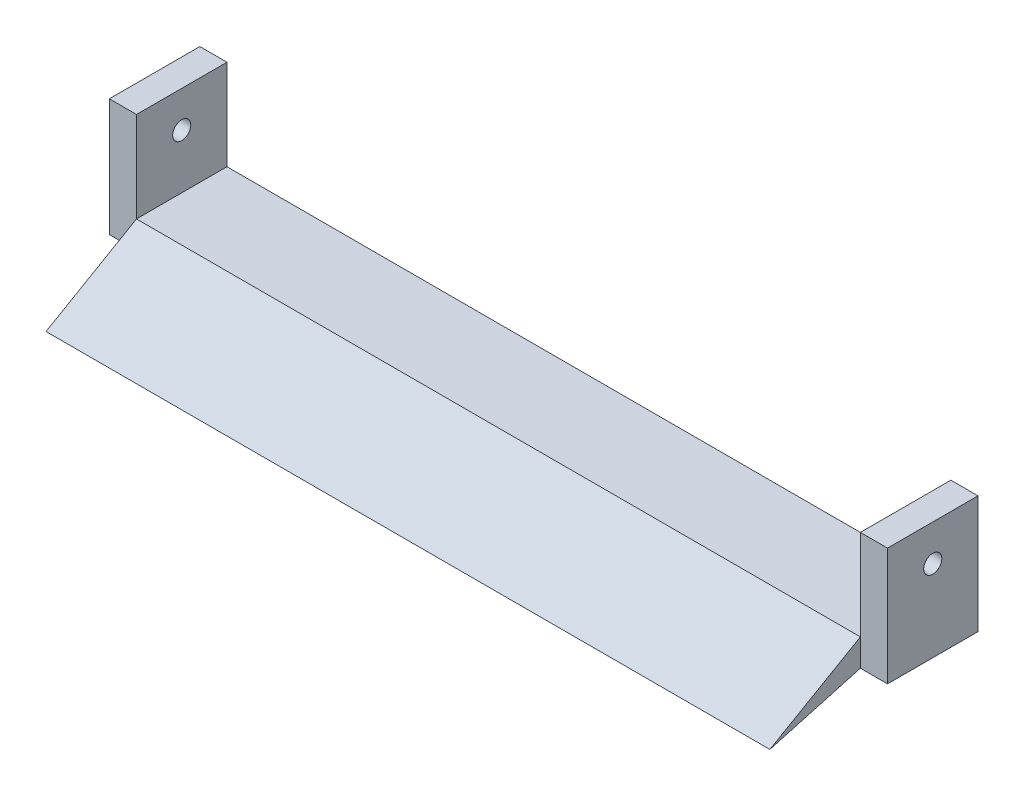
ISO-10303-21;
HEADER;
FILE_DESCRIPTION(('STEP AP214'),'2;1');
FILE_NAME('part.step','',(''),(''),'','','');
FILE_SCHEMA(('AUTOMOTIVE_DESIGN { 1 0 10303 214 1 1 1 1 }'));
ENDSEC;
DATA;
#1=APPLICATION_CONTEXT('core data for automotive mechanical design processes');
#2=APPLICATION_PROTOCOL_DEFINITION('international standard','automotive_design',2000,#1);
#3=PRODUCT_CONTEXT('',#1,'mechanical');
#4=PRODUCT('Part','Part','',(#3));
#5=PRODUCT_RELATED_PRODUCT_CATEGORY('part','',(#4));
#6=PRODUCT_DEFINITION_FORMATION('','',#4);
#7=PRODUCT_DEFINITION_CONTEXT('part definition',#1,'design');
#8=PRODUCT_DEFINITION('design','',#6,#7);
#9=PRODUCT_DEFINITION_SHAPE('','',#8);
#10=(LENGTH_UNIT() NAMED_UNIT(*) SI_UNIT(.MILLI.,.METRE.));
#11=(NAMED_UNIT(*) PLANE_ANGLE_UNIT() SI_UNIT($,.RADIAN.));
#12=(NAMED_UNIT(*) SI_UNIT($,.STERADIAN.) SOLID_ANGLE_UNIT());
#13=UNCERTAINTY_MEASURE_WITH_UNIT(LENGTH_MEASURE(1.E-05),#10,'distance_accuracy_value','');
#14=(GEOMETRIC_REPRESENTATION_CONTEXT(3) GLOBAL_UNCERTAINTY_ASSIGNED_CONTEXT((#13)) GLOBAL_UNIT_ASSIGNED_CONTEXT((#10,
#11,#12)) REPRESENTATION_CONTEXT('',''));
#15=CARTESIAN_POINT('',(0.,0.,0.));
#16=DIRECTION('',(0.,0.,1.));
#17=DIRECTION('',(1.,0.,0.));
#18=AXIS2_PLACEMENT_3D('',#15,#16,#17);
#19=CARTESIAN_POINT('',(0.,0.,50.));
#20=DIRECTION('',(0.,0.,-1.));
#21=DIRECTION('',(-1.,0.,0.));
#22=AXIS2_PLACEMENT_3D('',#19,#20,#21);
#23=PLANE('',#22);
#24=DIRECTION('',(0.,1.,0.));
#25=VECTOR('',#24,1.);
#26=CARTESIAN_POINT('',(200.,-17.5,50.));
#27=LINE('',#26,#25);
#28=CARTESIAN_POINT('',(200.,-32.5,50.));
#29=VERTEX_POINT('',#28);
#30=CARTESIAN_POINT('',(200.,-17.5,50.));
#31=VERTEX_POINT('',#30);
#32=EDGE_CURVE('E49',#29,#31,#27,.T.);
#33=ORIENTED_EDGE('',*,*,#32,.F.);
#34=DIRECTION('',(1.,0.,0.));
#35=VECTOR('',#34,1.);
#36=CARTESIAN_POINT('',(-215.,-32.5,50.));
#37=LINE('',#36,#35);
#38=CARTESIAN_POINT('',(215.,-32.5,50.));
#39=VERTEX_POINT('',#38);
#40=EDGE_CURVE('E180',#29,#39,#37,.T.);
#41=ORIENTED_EDGE('',*,*,#40,.T.);
#42=DIRECTION('',(0.,1.,0.));
#43=VECTOR('',#42,1.);
#44=CARTESIAN_POINT('',(215.,-32.5,50.));
#45=LINE('',#44,#43);
#46=CARTESIAN_POINT('',(215.,32.5,50.));
#47=VERTEX_POINT('',#46);
#48=EDGE_CURVE('E171',#39,#47,#45,.T.);
#49=ORIENTED_EDGE('',*,*,#48,.T.);
#50=DIRECTION('',(-1.,0.,0.));
#51=VECTOR('',#50,1.);
#52=CARTESIAN_POINT('',(200.,32.5,50.));
#53=LINE('',#52,#51);
#54=CARTESIAN_POINT('',(200.,32.5,50.));
#55=VERTEX_POINT('',#54);
#56=EDGE_CURVE('E135',#47,#55,#53,.T.);
#57=ORIENTED_EDGE('',*,*,#56,.T.);
#58=DIRECTION('',(0.,-1.,0.));
#59=VECTOR('',#58,1.);
#60=CARTESIAN_POINT('',(200.,32.5,50.));
#61=LINE('',#60,#59);
#62=EDGE_CURVE('E125',#55,#31,#61,.T.);
#63=ORIENTED_EDGE('',*,*,#62,.T.);
#64=EDGE_LOOP('',(#33,#41,#49,#57,#63));
#65=FACE_BOUND('',#64,.T.);
#66=ADVANCED_FACE('F33',(#65),#23,.F.);
#67=CARTESIAN_POINT('',(215.,-32.5,50.));
#68=DIRECTION('',(-1.,0.,0.));
#69=DIRECTION('',(0.,0.,1.));
#70=AXIS2_PLACEMENT_3D('',#67,#68,#69);
#71=PLANE('',#70);
#72=CARTESIAN_POINT('',(215.,12.5,25.));
#73=DIRECTION('',(1.,0.,0.));
#74=DIRECTION('',(0.,0.,-1.));
#75=AXIS2_PLACEMENT_3D('',#72,#73,#74);
#76=CIRCLE('',#75,5.);
#77=CARTESIAN_POINT('',(215.,12.5,20.));
#78=VERTEX_POINT('',#77);
#79=EDGE_CURVE('E161',#78,#78,#76,.T.);
#80=ORIENTED_EDGE('',*,*,#79,.F.);
#81=EDGE_LOOP('',(#80));
#82=FACE_BOUND('',#81,.T.);
#83=DIRECTION('',(0.,1.,0.));
#84=VECTOR('',#83,1.);
#85=CARTESIAN_POINT('',(215.,-32.5,0.));
#86=LINE('',#85,#84);
#87=CARTESIAN_POINT('',(215.,-32.5,0.));
#88=VERTEX_POINT('',#87);
#89=CARTESIAN_POINT('',(215.,32.5,0.));
#90=VERTEX_POINT('',#89);
#91=EDGE_CURVE('E170',#88,#90,#86,.T.);
#92=ORIENTED_EDGE('',*,*,#91,.T.);
#93=DIRECTION('',(0.,0.,-1.));
#94=VECTOR('',#93,1.);
#95=CARTESIAN_POINT('',(215.,32.5,50.));
#96=LINE('',#95,#94);
#97=EDGE_CURVE('E11',#47,#90,#96,.T.);
#98=ORIENTED_EDGE('',*,*,#97,.F.);
#99=ORIENTED_EDGE('',*,*,#48,.F.);
#100=DIRECTION('',(0.,0.,-1.));
#101=VECTOR('',#100,1.);
#102=CARTESIAN_POINT('',(215.,-32.5,50.));
#103=LINE('',#102,#101);
#104=EDGE_CURVE('E183',#39,#88,#103,.T.);
#105=ORIENTED_EDGE('',*,*,#104,.T.);
#106=EDGE_LOOP('',(#92,#98,#99,#105));
#107=FACE_BOUND('',#106,.T.);
#108=ADVANCED_FACE('F35',(#82,#107),#71,.F.);
#109=CARTESIAN_POINT('',(200.,32.5,50.));
#110=DIRECTION('',(0.,-1.,0.));
#111=DIRECTION('',(0.,0.,-1.));
#112=AXIS2_PLACEMENT_3D('',#109,#110,#111);
#113=PLANE('',#112);
#114=DIRECTION('',(-1.,0.,0.));
#115=VECTOR('',#114,1.);
#116=CARTESIAN_POINT('',(200.,32.5,0.));
#117=LINE('',#116,#115);
#118=CARTESIAN_POINT('',(200.,32.5,0.));
#119=VERTEX_POINT('',#118);
#120=EDGE_CURVE('E186',#90,#119,#117,.T.);
#121=ORIENTED_EDGE('',*,*,#120,.T.);
#122=DIRECTION('',(0.,0.,-1.));
#123=VECTOR('',#122,1.);
#124=CARTESIAN_POINT('',(200.,32.5,50.));
#125=LINE('',#124,#123);
#126=EDGE_CURVE('E42',#55,#119,#125,.T.);
#127=ORIENTED_EDGE('',*,*,#126,.F.);
#128=ORIENTED_EDGE('',*,*,#56,.F.);
#129=ORIENTED_EDGE('',*,*,#97,.T.);
#130=EDGE_LOOP('',(#121,#127,#128,#129));
#131=FACE_BOUND('',#130,.T.);
#132=ADVANCED_FACE('F244',(#131),#113,.F.);
#133=CARTESIAN_POINT('',(200.,32.5,50.));
#134=DIRECTION('',(1.,0.,0.));
#135=DIRECTION('',(0.,1.,0.));
#136=AXIS2_PLACEMENT_3D('',#133,#134,#135);
#137=PLANE('',#136);
#138=CARTESIAN_POINT('',(200.,12.5,25.));
#139=DIRECTION('',(1.,0.,0.));
#140=DIRECTION('',(0.,1.,0.));
#141=AXIS2_PLACEMENT_3D('',#138,#139,#140);
#142=CIRCLE('',#141,5.);
#143=CARTESIAN_POINT('',(200.,17.5,25.));
#144=VERTEX_POINT('',#143);
#145=EDGE_CURVE('E167',#144,#144,#142,.T.);
#146=ORIENTED_EDGE('',*,*,#145,.T.);
#147=EDGE_LOOP('',(#146));
#148=FACE_BOUND('',#147,.T.);
#149=DIRECTION('',(0.,-1.,0.));
#150=VECTOR('',#149,1.);
#151=CARTESIAN_POINT('',(200.,32.5,0.));
#152=LINE('',#151,#150);
#153=CARTESIAN_POINT('',(200.,-17.5,0.));
#154=VERTEX_POINT('',#153);
#155=EDGE_CURVE('E132',#119,#154,#152,.T.);
#156=ORIENTED_EDGE('',*,*,#155,.T.);
#157=DIRECTION('',(0.,0.,-1.));
#158=VECTOR('',#157,1.);
#159=CARTESIAN_POINT('',(200.,-17.5,50.));
#160=LINE('',#159,#158);
#161=EDGE_CURVE('E117',#31,#154,#160,.T.);
#162=ORIENTED_EDGE('',*,*,#161,.F.);
#163=ORIENTED_EDGE('',*,*,#62,.F.);
#164=ORIENTED_EDGE('',*,*,#126,.T.);
#165=EDGE_LOOP('',(#156,#162,#163,#164));
#166=FACE_BOUND('',#165,.T.);
#167=ADVANCED_FACE('F129',(#148,#166),#137,.F.);
#168=CARTESIAN_POINT('',(-200.,-17.5,50.));
#169=DIRECTION('',(0.,-1.,0.));
#170=DIRECTION('',(0.,0.,-1.));
#171=AXIS2_PLACEMENT_3D('',#168,#169,#170);
#172=PLANE('',#171);
#173=DIRECTION('',(-1.,0.,0.));
#174=VECTOR('',#173,1.);
#175=CARTESIAN_POINT('',(-200.,-17.5,0.));
#176=LINE('',#175,#174);
#177=CARTESIAN_POINT('',(-200.,-17.5,0.));
#178=VERTEX_POINT('',#177);
#179=EDGE_CURVE('E189',#154,#178,#176,.T.);
#180=ORIENTED_EDGE('',*,*,#179,.T.);
#181=DIRECTION('',(0.,0.,-1.));
#182=VECTOR('',#181,1.);
#183=CARTESIAN_POINT('',(-200.,-17.5,50.));
#184=LINE('',#183,#182);
#185=CARTESIAN_POINT('',(-200.,-17.5,50.));
#186=VERTEX_POINT('',#185);
#187=EDGE_CURVE('E120',#186,#178,#184,.T.);
#188=ORIENTED_EDGE('',*,*,#187,.F.);
#189=DIRECTION('',(-1.,0.,0.));
#190=VECTOR('',#189,1.);
#191=CARTESIAN_POINT('',(-200.,-17.5,50.));
#192=LINE('',#191,#190);
#193=EDGE_CURVE('E114',#31,#186,#192,.T.);
#194=ORIENTED_EDGE('',*,*,#193,.F.);
#195=ORIENTED_EDGE('',*,*,#161,.T.);
#196=EDGE_LOOP('',(#180,#188,#194,#195));
#197=FACE_BOUND('',#196,.T.);
#198=ADVANCED_FACE('F116',(#197),#172,.F.);
#199=CARTESIAN_POINT('',(-200.,32.5,50.));
#200=DIRECTION('',(-1.,0.,0.));
#201=DIRECTION('',(0.,-1.,0.));
#202=AXIS2_PLACEMENT_3D('',#199,#200,#201);
#203=PLANE('',#202);
#204=CARTESIAN_POINT('',(-200.,12.5,25.));
#205=DIRECTION('',(-1.,0.,0.));
#206=DIRECTION('',(0.,-1.,0.));
#207=AXIS2_PLACEMENT_3D('',#204,#205,#206);
#208=CIRCLE('',#207,5.);
#209=CARTESIAN_POINT('',(-200.,7.49999999999997,25.));
#210=VERTEX_POINT('',#209);
#211=EDGE_CURVE('E164',#210,#210,#208,.T.);
#212=ORIENTED_EDGE('',*,*,#211,.T.);
#213=EDGE_LOOP('',(#212));
#214=FACE_BOUND('',#213,.T.);
#215=DIRECTION('',(0.,1.,0.));
#216=VECTOR('',#215,1.);
#217=CARTESIAN_POINT('',(-200.,32.5,0.));
#218=LINE('',#217,#216);
#219=CARTESIAN_POINT('',(-200.,32.5,0.));
#220=VERTEX_POINT('',#219);
#221=EDGE_CURVE('E191',#178,#220,#218,.T.);
#222=ORIENTED_EDGE('',*,*,#221,.T.);
#223=DIRECTION('',(0.,0.,-1.));
#224=VECTOR('',#223,1.);
#225=CARTESIAN_POINT('',(-200.,32.5,50.));
#226=LINE('',#225,#224);
#227=CARTESIAN_POINT('',(-200.,32.5,50.));
#228=VERTEX_POINT('',#227);
#229=EDGE_CURVE('E206',#228,#220,#226,.T.);
#230=ORIENTED_EDGE('',*,*,#229,.F.);
#231=DIRECTION('',(0.,1.,0.));
#232=VECTOR('',#231,1.);
#233=CARTESIAN_POINT('',(-200.,32.5,50.));
#234=LINE('',#233,#232);
#235=EDGE_CURVE('E124',#186,#228,#234,.T.);
#236=ORIENTED_EDGE('',*,*,#235,.F.);
#237=ORIENTED_EDGE('',*,*,#187,.T.);
#238=EDGE_LOOP('',(#222,#230,#236,#237));
#239=FACE_BOUND('',#238,.T.);
#240=ADVANCED_FACE('F217',(#214,#239),#203,.F.);
#241=CARTESIAN_POINT('',(-215.,32.5,50.));
#242=DIRECTION('',(0.,-1.,0.));
#243=DIRECTION('',(0.,0.,-1.));
#244=AXIS2_PLACEMENT_3D('',#241,#242,#243);
#245=PLANE('',#244);
#246=DIRECTION('',(-1.,0.,0.));
#247=VECTOR('',#246,1.);
#248=CARTESIAN_POINT('',(-215.,32.5,0.));
#249=LINE('',#248,#247);
#250=CARTESIAN_POINT('',(-215.,32.5,0.));
#251=VERTEX_POINT('',#250);
#252=EDGE_CURVE('E193',#220,#251,#249,.T.);
#253=ORIENTED_EDGE('',*,*,#252,.T.);
#254=DIRECTION('',(0.,0.,-1.));
#255=VECTOR('',#254,1.);
#256=CARTESIAN_POINT('',(-215.,32.5,50.));
#257=LINE('',#256,#255);
#258=CARTESIAN_POINT('',(-215.,32.5,50.));
#259=VERTEX_POINT('',#258);
#260=EDGE_CURVE('E203',#259,#251,#257,.T.);
#261=ORIENTED_EDGE('',*,*,#260,.F.);
#262=DIRECTION('',(-1.,0.,0.));
#263=VECTOR('',#262,1.);
#264=CARTESIAN_POINT('',(-215.,32.5,50.));
#265=LINE('',#264,#263);
#266=EDGE_CURVE('E176',#228,#259,#265,.T.);
#267=ORIENTED_EDGE('',*,*,#266,.F.);
#268=ORIENTED_EDGE('',*,*,#229,.T.);
#269=EDGE_LOOP('',(#253,#261,#267,#268));
#270=FACE_BOUND('',#269,.T.);
#271=ADVANCED_FACE('F277',(#270),#245,.F.);
#272=CARTESIAN_POINT('',(-215.,-32.5,50.));
#273=DIRECTION('',(1.,0.,0.));
#274=DIRECTION('',(0.,0.,-1.));
#275=AXIS2_PLACEMENT_3D('',#272,#273,#274);
#276=PLANE('',#275);
#277=CARTESIAN_POINT('',(-215.,12.5,25.));
#278=DIRECTION('',(1.,0.,0.));
#279=DIRECTION('',(0.,0.,-1.));
#280=AXIS2_PLACEMENT_3D('',#277,#278,#279);
#281=CIRCLE('',#280,5.);
#282=CARTESIAN_POINT('',(-215.,12.5,20.));
#283=VERTEX_POINT('',#282);
#284=EDGE_CURVE('E37',#283,#283,#281,.T.);
#285=ORIENTED_EDGE('',*,*,#284,.T.);
#286=EDGE_LOOP('',(#285));
#287=FACE_BOUND('',#286,.T.);
#288=DIRECTION('',(0.,-1.,0.));
#289=VECTOR('',#288,1.);
#290=CARTESIAN_POINT('',(-215.,-32.5,0.));
#291=LINE('',#290,#289);
#292=CARTESIAN_POINT('',(-215.,-32.5,0.));
#293=VERTEX_POINT('',#292);
#294=EDGE_CURVE('E195',#251,#293,#291,.T.);
#295=ORIENTED_EDGE('',*,*,#294,.T.);
#296=DIRECTION('',(0.,0.,-1.));
#297=VECTOR('',#296,1.);
#298=CARTESIAN_POINT('',(-215.,-32.5,50.));
#299=LINE('',#298,#297);
#300=CARTESIAN_POINT('',(-215.,-32.5,50.));
#301=VERTEX_POINT('',#300);
#302=EDGE_CURVE('E200',#301,#293,#299,.T.);
#303=ORIENTED_EDGE('',*,*,#302,.F.);
#304=DIRECTION('',(0.,-1.,0.));
#305=VECTOR('',#304,1.);
#306=CARTESIAN_POINT('',(-215.,-32.5,50.));
#307=LINE('',#306,#305);
#308=EDGE_CURVE('E178',#259,#301,#307,.T.);
#309=ORIENTED_EDGE('',*,*,#308,.F.);
#310=ORIENTED_EDGE('',*,*,#260,.T.);
#311=EDGE_LOOP('',(#295,#303,#309,#310));
#312=FACE_BOUND('',#311,.T.);
#313=ADVANCED_FACE('F255',(#287,#312),#276,.F.);
#314=CARTESIAN_POINT('',(-215.,-32.5,50.));
#315=DIRECTION('',(0.,1.,0.));
#316=DIRECTION('',(0.,0.,1.));
#317=AXIS2_PLACEMENT_3D('',#314,#315,#316);
#318=PLANE('',#317);
#319=DIRECTION('',(1.,0.,0.));
#320=VECTOR('',#319,1.);
#321=CARTESIAN_POINT('',(-215.,-32.5,0.));
#322=LINE('',#321,#320);
#323=EDGE_CURVE('E173',#293,#88,#322,.T.);
#324=ORIENTED_EDGE('',*,*,#323,.T.);
#325=ORIENTED_EDGE('',*,*,#104,.F.);
#326=ORIENTED_EDGE('',*,*,#40,.F.);
#327=DIRECTION('',(-1.,0.,0.));
#328=VECTOR('',#327,1.);
#329=CARTESIAN_POINT('',(200.,-32.5,50.));
#330=LINE('',#329,#328);
#331=CARTESIAN_POINT('',(-200.,-32.5,50.));
#332=VERTEX_POINT('',#331);
#333=EDGE_CURVE('E56',#29,#332,#330,.T.);
#334=ORIENTED_EDGE('',*,*,#333,.T.);
#335=EDGE_CURVE('E181',#301,#332,#37,.T.);
#336=ORIENTED_EDGE('',*,*,#335,.F.);
#337=ORIENTED_EDGE('',*,*,#302,.T.);
#338=EDGE_LOOP('',(#324,#325,#326,#334,#336,#337));
#339=FACE_BOUND('',#338,.T.);
#340=ADVANCED_FACE('F249',(#339),#318,.F.);
#341=ORIENTED_EDGE('',*,*,#335,.T.);
#342=DIRECTION('',(0.,1.,0.));
#343=VECTOR('',#342,1.);
#344=CARTESIAN_POINT('',(-200.,-17.5,50.));
#345=LINE('',#344,#343);
#346=EDGE_CURVE('E156',#332,#186,#345,.T.);
#347=ORIENTED_EDGE('',*,*,#346,.T.);
#348=ORIENTED_EDGE('',*,*,#235,.T.);
#349=ORIENTED_EDGE('',*,*,#266,.T.);
#350=ORIENTED_EDGE('',*,*,#308,.T.);
#351=EDGE_LOOP('',(#341,#347,#348,#349,#350));
#352=FACE_BOUND('',#351,.T.);
#353=ADVANCED_FACE('F240',(#352),#23,.F.);
#354=CARTESIAN_POINT('',(0.,0.,0.));
#355=DIRECTION('',(0.,0.,-1.));
#356=DIRECTION('',(-1.,0.,0.));
#357=AXIS2_PLACEMENT_3D('',#354,#355,#356);
#358=PLANE('',#357);
#359=ORIENTED_EDGE('',*,*,#91,.F.);
#360=ORIENTED_EDGE('',*,*,#323,.F.);
#361=ORIENTED_EDGE('',*,*,#294,.F.);
#362=ORIENTED_EDGE('',*,*,#252,.F.);
#363=ORIENTED_EDGE('',*,*,#221,.F.);
#364=ORIENTED_EDGE('',*,*,#179,.F.);
#365=ORIENTED_EDGE('',*,*,#155,.F.);
#366=ORIENTED_EDGE('',*,*,#120,.F.);
#367=EDGE_LOOP('',(#359,#360,#361,#362,#363,#364,#365,#366));
#368=FACE_BOUND('',#367,.T.);
#369=ADVANCED_FACE('F213',(#368),#358,.T.);
#370=CARTESIAN_POINT('',(-262.,12.5,25.));
#371=DIRECTION('',(1.,0.,0.));
#372=DIRECTION('',(0.,0.,-1.));
#373=AXIS2_PLACEMENT_3D('',#370,#371,#372);
#374=CYLINDRICAL_SURFACE('',#373,5.);
#375=ORIENTED_EDGE('',*,*,#284,.F.);
#376=EDGE_LOOP('',(#375));
#377=FACE_BOUND('',#376,.T.);
#378=ORIENTED_EDGE('',*,*,#211,.F.);
#379=EDGE_LOOP('',(#378));
#380=FACE_BOUND('',#379,.T.);
#381=ADVANCED_FACE('F254',(#377,#380),#374,.F.);
#382=ORIENTED_EDGE('',*,*,#79,.T.);
#383=EDGE_LOOP('',(#382));
#384=FACE_BOUND('',#383,.T.);
#385=ORIENTED_EDGE('',*,*,#145,.F.);
#386=EDGE_LOOP('',(#385));
#387=FACE_BOUND('',#386,.T.);
#388=ADVANCED_FACE('F235',(#384,#387),#374,.F.);
#389=CARTESIAN_POINT('',(200.,-46.3675134594812,100.));
#390=DIRECTION('',(0.,-0.86602540378444,-0.499999999999998));
#391=DIRECTION('',(0.,0.499999999999998,-0.86602540378444));
#392=AXIS2_PLACEMENT_3D('',#389,#390,#391);
#393=PLANE('',#392);
#394=DIRECTION('',(0.,-0.499999999999998,0.86602540378444));
#395=VECTOR('',#394,1.);
#396=CARTESIAN_POINT('',(-200.,-46.3675134594812,100.));
#397=LINE('',#396,#395);
#398=CARTESIAN_POINT('',(-200.,-46.3675134594812,100.));
#399=VERTEX_POINT('',#398);
#400=EDGE_CURVE('E152',#186,#399,#397,.T.);
#401=ORIENTED_EDGE('',*,*,#400,.T.);
#402=DIRECTION('',(-1.,0.,0.));
#403=VECTOR('',#402,1.);
#404=CARTESIAN_POINT('',(200.,-46.3675134594812,100.));
#405=LINE('',#404,#403);
#406=CARTESIAN_POINT('',(200.,-46.3675134594812,100.));
#407=VERTEX_POINT('',#406);
#408=EDGE_CURVE('E142',#407,#399,#405,.T.);
#409=ORIENTED_EDGE('',*,*,#408,.F.);
#410=DIRECTION('',(0.,-0.499999999999998,0.86602540378444));
#411=VECTOR('',#410,1.);
#412=CARTESIAN_POINT('',(200.,-46.3675134594812,100.));
#413=LINE('',#412,#411);
#414=EDGE_CURVE('E139',#31,#407,#413,.T.);
#415=ORIENTED_EDGE('',*,*,#414,.F.);
#416=ORIENTED_EDGE('',*,*,#193,.T.);
#417=EDGE_LOOP('',(#401,#409,#415,#416));
#418=FACE_BOUND('',#417,.T.);
#419=ADVANCED_FACE('F140',(#418),#393,.F.);
#420=CARTESIAN_POINT('',(200.,-32.5,50.));
#421=DIRECTION('',(0.,0.963624069203043,0.267261394991063));
#422=DIRECTION('',(0.,-0.267261394991063,0.963624069203043));
#423=AXIS2_PLACEMENT_3D('',#420,#421,#422);
#424=PLANE('',#423);
#425=DIRECTION('',(0.,0.267261394991063,-0.963624069203043));
#426=VECTOR('',#425,1.);
#427=CARTESIAN_POINT('',(-200.,-32.5,50.));
#428=LINE('',#427,#426);
#429=EDGE_CURVE('E149',#399,#332,#428,.T.);
#430=ORIENTED_EDGE('',*,*,#429,.T.);
#431=ORIENTED_EDGE('',*,*,#333,.F.);
#432=DIRECTION('',(0.,0.267261394991063,-0.963624069203043));
#433=VECTOR('',#432,1.);
#434=CARTESIAN_POINT('',(200.,-32.5,50.));
#435=LINE('',#434,#433);
#436=EDGE_CURVE('E146',#407,#29,#435,.T.);
#437=ORIENTED_EDGE('',*,*,#436,.F.);
#438=ORIENTED_EDGE('',*,*,#408,.T.);
#439=EDGE_LOOP('',(#430,#431,#437,#438));
#440=FACE_BOUND('',#439,.T.);
#441=ADVANCED_FACE('F227',(#440),#424,.F.);
#442=CARTESIAN_POINT('',(200.,0.,0.));
#443=DIRECTION('',(-1.,0.,0.));
#444=DIRECTION('',(0.,0.,1.));
#445=AXIS2_PLACEMENT_3D('',#442,#443,#444);
#446=PLANE('',#445);
#447=ORIENTED_EDGE('',*,*,#32,.T.);
#448=ORIENTED_EDGE('',*,*,#414,.T.);
#449=ORIENTED_EDGE('',*,*,#436,.T.);
#450=EDGE_LOOP('',(#447,#448,#449));
#451=FACE_BOUND('',#450,.T.);
#452=ADVANCED_FACE('F148',(#451),#446,.F.);
#453=CARTESIAN_POINT('',(-200.,0.,0.));
#454=DIRECTION('',(-1.,0.,0.));
#455=DIRECTION('',(0.,0.,1.));
#456=AXIS2_PLACEMENT_3D('',#453,#454,#455);
#457=PLANE('',#456);
#458=ORIENTED_EDGE('',*,*,#346,.F.);
#459=ORIENTED_EDGE('',*,*,#429,.F.);
#460=ORIENTED_EDGE('',*,*,#400,.F.);
#461=EDGE_LOOP('',(#458,#459,#460));
#462=FACE_BOUND('',#461,.T.);
#463=ADVANCED_FACE('F225',(#462),#457,.T.);
#464=CLOSED_SHELL('',(#66,#108,#132,#167,#198,#240,#271,#313,#340,#353,#369,#381,#388,#419,#441,
#452,#463));
#465=MANIFOLD_SOLID_BREP('B2',#464);
#466=ADVANCED_BREP_SHAPE_REPRESENTATION('',(#18,#465),#14);
#467=SHAPE_DEFINITION_REPRESENTATION(#9,#466);
ENDSEC;
END-ISO-10303-21;
